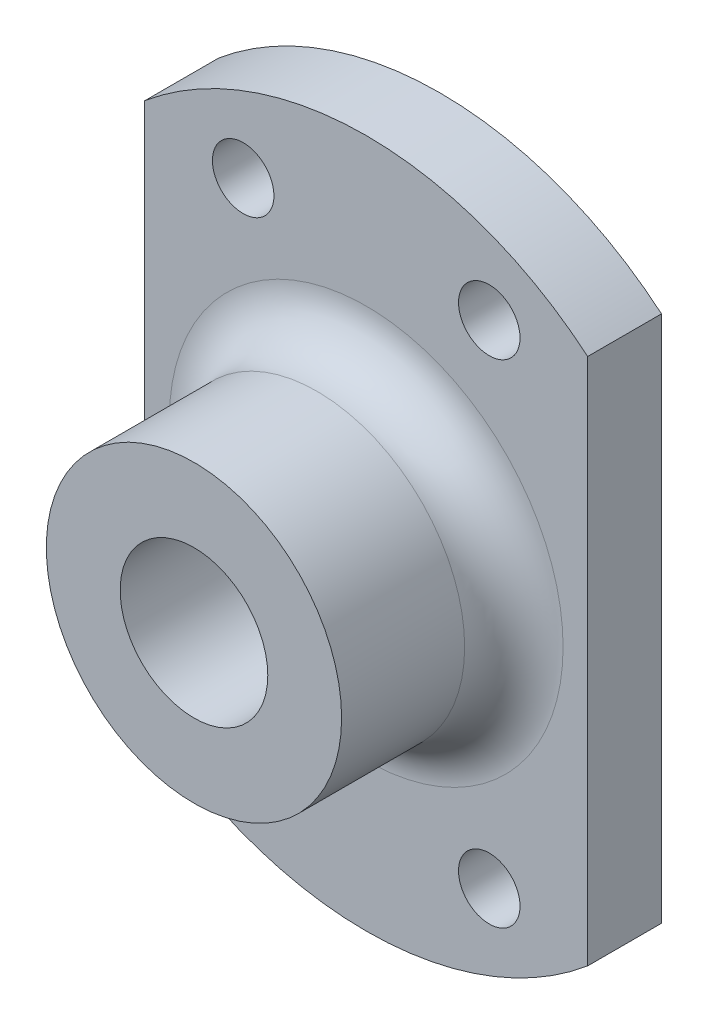
ISO-10303-21;
HEADER;
FILE_DESCRIPTION(('STEP AP214'),'2;1');
FILE_NAME('part.step','',(''),(''),'','','');
FILE_SCHEMA(('AUTOMOTIVE_DESIGN { 1 0 10303 214 1 1 1 1 }'));
ENDSEC;
DATA;
#1=APPLICATION_CONTEXT('core data for automotive mechanical design processes');
#2=APPLICATION_PROTOCOL_DEFINITION('international standard','automotive_design',2000,#1);
#3=PRODUCT_CONTEXT('',#1,'mechanical');
#4=PRODUCT('Part','Part','',(#3));
#5=PRODUCT_RELATED_PRODUCT_CATEGORY('part','',(#4));
#6=PRODUCT_DEFINITION_FORMATION('','',#4);
#7=PRODUCT_DEFINITION_CONTEXT('part definition',#1,'design');
#8=PRODUCT_DEFINITION('design','',#6,#7);
#9=PRODUCT_DEFINITION_SHAPE('','',#8);
#10=(LENGTH_UNIT() NAMED_UNIT(*) SI_UNIT(.MILLI.,.METRE.));
#11=(NAMED_UNIT(*) PLANE_ANGLE_UNIT() SI_UNIT($,.RADIAN.));
#12=(NAMED_UNIT(*) SI_UNIT($,.STERADIAN.) SOLID_ANGLE_UNIT());
#13=UNCERTAINTY_MEASURE_WITH_UNIT(LENGTH_MEASURE(1.E-05),#10,'distance_accuracy_value','');
#14=(GEOMETRIC_REPRESENTATION_CONTEXT(3) GLOBAL_UNCERTAINTY_ASSIGNED_CONTEXT((#13)) GLOBAL_UNIT_ASSIGNED_CONTEXT((#10,
#11,#12)) REPRESENTATION_CONTEXT('',''));
#15=CARTESIAN_POINT('',(0.,0.,0.));
#16=DIRECTION('',(0.,0.,1.));
#17=DIRECTION('',(1.,0.,0.));
#18=AXIS2_PLACEMENT_3D('',#15,#16,#17);
#19=CARTESIAN_POINT('',(0.,0.,3.));
#20=DIRECTION('',(0.,0.,1.));
#21=DIRECTION('',(1.,0.,0.));
#22=AXIS2_PLACEMENT_3D('',#19,#20,#21);
#23=PLANE('',#22);
#24=CARTESIAN_POINT('',(0.,0.,3.));
#25=DIRECTION('',(0.,0.,1.));
#26=DIRECTION('',(1.,0.,0.));
#27=AXIS2_PLACEMENT_3D('',#24,#25,#26);
#28=CIRCLE('',#27,8.);
#29=CARTESIAN_POINT('',(8.,0.,3.));
#30=VERTEX_POINT('',#29);
#31=EDGE_CURVE('E11',#30,#30,#28,.F.);
#32=ORIENTED_EDGE('',*,*,#31,.T.);
#33=EDGE_LOOP('',(#32));
#34=FACE_BOUND('',#33,.T.);
#35=CARTESIAN_POINT('',(5.,-10.,3.));
#36=DIRECTION('',(0.,0.,1.));
#37=DIRECTION('',(1.,0.,0.));
#38=AXIS2_PLACEMENT_3D('',#35,#36,#37);
#39=CIRCLE('',#38,1.25);
#40=CARTESIAN_POINT('',(6.25,-10.,3.));
#41=VERTEX_POINT('',#40);
#42=EDGE_CURVE('E170',#41,#41,#39,.T.);
#43=ORIENTED_EDGE('',*,*,#42,.F.);
#44=EDGE_LOOP('',(#43));
#45=FACE_BOUND('',#44,.T.);
#46=CARTESIAN_POINT('',(5.,10.,3.));
#47=DIRECTION('',(0.,0.,1.));
#48=DIRECTION('',(1.,0.,0.));
#49=AXIS2_PLACEMENT_3D('',#46,#47,#48);
#50=CIRCLE('',#49,1.25);
#51=CARTESIAN_POINT('',(6.25,10.,3.));
#52=VERTEX_POINT('',#51);
#53=EDGE_CURVE('E183',#52,#52,#50,.T.);
#54=ORIENTED_EDGE('',*,*,#53,.F.);
#55=EDGE_LOOP('',(#54));
#56=FACE_BOUND('',#55,.T.);
#57=CARTESIAN_POINT('',(0.,0.,3.));
#58=DIRECTION('',(0.,0.,1.));
#59=DIRECTION('',(1.,0.,0.));
#60=AXIS2_PLACEMENT_3D('',#57,#58,#59);
#61=CIRCLE('',#60,14.);
#62=CARTESIAN_POINT('',(9.,10.7238052947636,3.));
#63=VERTEX_POINT('',#62);
#64=CARTESIAN_POINT('',(-9.,10.7238052947636,3.));
#65=VERTEX_POINT('',#64);
#66=EDGE_CURVE('E86',#63,#65,#61,.T.);
#67=ORIENTED_EDGE('',*,*,#66,.T.);
#68=DIRECTION('',(0.,-1.,0.));
#69=VECTOR('',#68,1.);
#70=CARTESIAN_POINT('',(-9.,10.7238052947636,3.));
#71=LINE('',#70,#69);
#72=CARTESIAN_POINT('',(-9.,-10.7238052947636,3.));
#73=VERTEX_POINT('',#72);
#74=EDGE_CURVE('E81',#65,#73,#71,.T.);
#75=ORIENTED_EDGE('',*,*,#74,.T.);
#76=CARTESIAN_POINT('',(0.,0.,3.));
#77=DIRECTION('',(0.,0.,1.));
#78=DIRECTION('',(1.,0.,0.));
#79=AXIS2_PLACEMENT_3D('',#76,#77,#78);
#80=CIRCLE('',#79,14.);
#81=CARTESIAN_POINT('',(9.,-10.7238052947636,3.));
#82=VERTEX_POINT('',#81);
#83=EDGE_CURVE('E84',#73,#82,#80,.T.);
#84=ORIENTED_EDGE('',*,*,#83,.T.);
#85=DIRECTION('',(0.,1.,0.));
#86=VECTOR('',#85,1.);
#87=CARTESIAN_POINT('',(9.,10.7238052947636,3.));
#88=LINE('',#87,#86);
#89=EDGE_CURVE('E50',#82,#63,#88,.T.);
#90=ORIENTED_EDGE('',*,*,#89,.T.);
#91=EDGE_LOOP('',(#67,#75,#84,#90));
#92=FACE_BOUND('',#91,.T.);
#93=CARTESIAN_POINT('',(-5.,10.,3.));
#94=DIRECTION('',(0.,0.,1.));
#95=DIRECTION('',(1.,0.,0.));
#96=AXIS2_PLACEMENT_3D('',#93,#94,#95);
#97=CIRCLE('',#96,1.25);
#98=CARTESIAN_POINT('',(-3.75,10.,3.));
#99=VERTEX_POINT('',#98);
#100=EDGE_CURVE('E187',#99,#99,#97,.T.);
#101=ORIENTED_EDGE('',*,*,#100,.F.);
#102=EDGE_LOOP('',(#101));
#103=FACE_BOUND('',#102,.T.);
#104=CARTESIAN_POINT('',(-5.,-10.,3.));
#105=DIRECTION('',(0.,0.,1.));
#106=DIRECTION('',(1.,0.,0.));
#107=AXIS2_PLACEMENT_3D('',#104,#105,#106);
#108=CIRCLE('',#107,1.25);
#109=CARTESIAN_POINT('',(-3.75,-10.,3.));
#110=VERTEX_POINT('',#109);
#111=EDGE_CURVE('E179',#110,#110,#108,.T.);
#112=ORIENTED_EDGE('',*,*,#111,.F.);
#113=EDGE_LOOP('',(#112));
#114=FACE_BOUND('',#113,.T.);
#115=ADVANCED_FACE('F33',(#34,#45,#56,#92,#103,#114),#23,.T.);
#116=CARTESIAN_POINT('',(0.,0.,0.));
#117=DIRECTION('',(0.,0.,1.));
#118=DIRECTION('',(1.,0.,0.));
#119=AXIS2_PLACEMENT_3D('',#116,#117,#118);
#120=PLANE('',#119);
#121=CARTESIAN_POINT('',(0.,0.,0.));
#122=DIRECTION('',(0.,0.,1.));
#123=DIRECTION('',(1.,0.,0.));
#124=AXIS2_PLACEMENT_3D('',#121,#122,#123);
#125=CIRCLE('',#124,14.);
#126=CARTESIAN_POINT('',(9.,10.7238052947636,0.));
#127=VERTEX_POINT('',#126);
#128=CARTESIAN_POINT('',(-9.,10.7238052947636,0.));
#129=VERTEX_POINT('',#128);
#130=EDGE_CURVE('E101',#127,#129,#125,.T.);
#131=ORIENTED_EDGE('',*,*,#130,.F.);
#132=DIRECTION('',(0.,1.,0.));
#133=VECTOR('',#132,1.);
#134=CARTESIAN_POINT('',(9.,10.7238052947636,0.));
#135=LINE('',#134,#133);
#136=CARTESIAN_POINT('',(9.,-10.7238052947636,0.));
#137=VERTEX_POINT('',#136);
#138=EDGE_CURVE('E73',#137,#127,#135,.T.);
#139=ORIENTED_EDGE('',*,*,#138,.F.);
#140=CARTESIAN_POINT('',(0.,0.,0.));
#141=DIRECTION('',(0.,0.,1.));
#142=DIRECTION('',(1.,0.,0.));
#143=AXIS2_PLACEMENT_3D('',#140,#141,#142);
#144=CIRCLE('',#143,14.);
#145=CARTESIAN_POINT('',(-9.,-10.7238052947636,0.));
#146=VERTEX_POINT('',#145);
#147=EDGE_CURVE('E67',#146,#137,#144,.T.);
#148=ORIENTED_EDGE('',*,*,#147,.F.);
#149=DIRECTION('',(0.,-1.,0.));
#150=VECTOR('',#149,1.);
#151=CARTESIAN_POINT('',(-9.,10.7238052947636,0.));
#152=LINE('',#151,#150);
#153=EDGE_CURVE('E91',#129,#146,#152,.T.);
#154=ORIENTED_EDGE('',*,*,#153,.F.);
#155=EDGE_LOOP('',(#131,#139,#148,#154));
#156=FACE_BOUND('',#155,.T.);
#157=CARTESIAN_POINT('',(0.,0.,0.));
#158=DIRECTION('',(0.,0.,1.));
#159=DIRECTION('',(1.,0.,0.));
#160=AXIS2_PLACEMENT_3D('',#157,#158,#159);
#161=CIRCLE('',#160,3.);
#162=CARTESIAN_POINT('',(3.,0.,0.));
#163=VERTEX_POINT('',#162);
#164=EDGE_CURVE('E104',#163,#163,#161,.T.);
#165=ORIENTED_EDGE('',*,*,#164,.T.);
#166=EDGE_LOOP('',(#165));
#167=FACE_BOUND('',#166,.T.);
#168=CARTESIAN_POINT('',(-5.,10.,0.));
#169=DIRECTION('',(0.,0.,1.));
#170=DIRECTION('',(1.,0.,0.));
#171=AXIS2_PLACEMENT_3D('',#168,#169,#170);
#172=CIRCLE('',#171,1.25);
#173=CARTESIAN_POINT('',(-3.75,10.,0.));
#174=VERTEX_POINT('',#173);
#175=EDGE_CURVE('E157',#174,#174,#172,.T.);
#176=ORIENTED_EDGE('',*,*,#175,.T.);
#177=EDGE_LOOP('',(#176));
#178=FACE_BOUND('',#177,.T.);
#179=CARTESIAN_POINT('',(5.,10.,0.));
#180=DIRECTION('',(0.,0.,1.));
#181=DIRECTION('',(1.,0.,0.));
#182=AXIS2_PLACEMENT_3D('',#179,#180,#181);
#183=CIRCLE('',#182,1.25);
#184=CARTESIAN_POINT('',(6.25,10.,0.));
#185=VERTEX_POINT('',#184);
#186=EDGE_CURVE('E161',#185,#185,#183,.T.);
#187=ORIENTED_EDGE('',*,*,#186,.T.);
#188=EDGE_LOOP('',(#187));
#189=FACE_BOUND('',#188,.T.);
#190=CARTESIAN_POINT('',(-5.,-10.,0.));
#191=DIRECTION('',(0.,0.,1.));
#192=DIRECTION('',(1.,0.,0.));
#193=AXIS2_PLACEMENT_3D('',#190,#191,#192);
#194=CIRCLE('',#193,1.25);
#195=CARTESIAN_POINT('',(-3.75,-10.,0.));
#196=VERTEX_POINT('',#195);
#197=EDGE_CURVE('E165',#196,#196,#194,.T.);
#198=ORIENTED_EDGE('',*,*,#197,.T.);
#199=EDGE_LOOP('',(#198));
#200=FACE_BOUND('',#199,.T.);
#201=CARTESIAN_POINT('',(5.,-10.,0.));
#202=DIRECTION('',(0.,0.,1.));
#203=DIRECTION('',(1.,0.,0.));
#204=AXIS2_PLACEMENT_3D('',#201,#202,#203);
#205=CIRCLE('',#204,1.25);
#206=CARTESIAN_POINT('',(6.25,-10.,0.));
#207=VERTEX_POINT('',#206);
#208=EDGE_CURVE('E168',#207,#207,#205,.T.);
#209=ORIENTED_EDGE('',*,*,#208,.T.);
#210=EDGE_LOOP('',(#209));
#211=FACE_BOUND('',#210,.T.);
#212=ADVANCED_FACE('F125',(#156,#167,#178,#189,#200,#211),#120,.F.);
#213=CARTESIAN_POINT('',(0.,0.,3.));
#214=DIRECTION('',(0.,0.,-1.));
#215=DIRECTION('',(-1.,0.,0.));
#216=AXIS2_PLACEMENT_3D('',#213,#214,#215);
#217=CYLINDRICAL_SURFACE('',#216,14.);
#218=ORIENTED_EDGE('',*,*,#130,.T.);
#219=DIRECTION('',(0.,0.,-1.));
#220=VECTOR('',#219,1.);
#221=CARTESIAN_POINT('',(-9.,10.7238052947636,3.));
#222=LINE('',#221,#220);
#223=EDGE_CURVE('E92',#65,#129,#222,.T.);
#224=ORIENTED_EDGE('',*,*,#223,.F.);
#225=ORIENTED_EDGE('',*,*,#66,.F.);
#226=DIRECTION('',(0.,0.,-1.));
#227=VECTOR('',#226,1.);
#228=CARTESIAN_POINT('',(9.,10.7238052947636,3.));
#229=LINE('',#228,#227);
#230=EDGE_CURVE('E97',#63,#127,#229,.T.);
#231=ORIENTED_EDGE('',*,*,#230,.T.);
#232=EDGE_LOOP('',(#218,#224,#225,#231));
#233=FACE_BOUND('',#232,.T.);
#234=ADVANCED_FACE('F131',(#233),#217,.T.);
#235=CARTESIAN_POINT('',(-9.,10.7238052947636,3.));
#236=DIRECTION('',(1.,0.,0.));
#237=DIRECTION('',(0.,0.,-1.));
#238=AXIS2_PLACEMENT_3D('',#235,#236,#237);
#239=PLANE('',#238);
#240=ORIENTED_EDGE('',*,*,#153,.T.);
#241=DIRECTION('',(0.,0.,-1.));
#242=VECTOR('',#241,1.);
#243=CARTESIAN_POINT('',(-9.,-10.7238052947636,3.));
#244=LINE('',#243,#242);
#245=EDGE_CURVE('E89',#73,#146,#244,.T.);
#246=ORIENTED_EDGE('',*,*,#245,.F.);
#247=ORIENTED_EDGE('',*,*,#74,.F.);
#248=ORIENTED_EDGE('',*,*,#223,.T.);
#249=EDGE_LOOP('',(#240,#246,#247,#248));
#250=FACE_BOUND('',#249,.T.);
#251=ADVANCED_FACE('F90',(#250),#239,.F.);
#252=CARTESIAN_POINT('',(0.,0.,3.));
#253=DIRECTION('',(0.,0.,-1.));
#254=DIRECTION('',(-1.,0.,0.));
#255=AXIS2_PLACEMENT_3D('',#252,#253,#254);
#256=CYLINDRICAL_SURFACE('',#255,14.);
#257=ORIENTED_EDGE('',*,*,#147,.T.);
#258=DIRECTION('',(0.,0.,-1.));
#259=VECTOR('',#258,1.);
#260=CARTESIAN_POINT('',(9.,-10.7238052947636,3.));
#261=LINE('',#260,#259);
#262=EDGE_CURVE('E93',#82,#137,#261,.T.);
#263=ORIENTED_EDGE('',*,*,#262,.F.);
#264=ORIENTED_EDGE('',*,*,#83,.F.);
#265=ORIENTED_EDGE('',*,*,#245,.T.);
#266=EDGE_LOOP('',(#257,#263,#264,#265));
#267=FACE_BOUND('',#266,.T.);
#268=ADVANCED_FACE('F95',(#267),#256,.T.);
#269=CARTESIAN_POINT('',(9.,10.7238052947636,3.));
#270=DIRECTION('',(-1.,0.,0.));
#271=DIRECTION('',(0.,0.,1.));
#272=AXIS2_PLACEMENT_3D('',#269,#270,#271);
#273=PLANE('',#272);
#274=ORIENTED_EDGE('',*,*,#138,.T.);
#275=ORIENTED_EDGE('',*,*,#230,.F.);
#276=ORIENTED_EDGE('',*,*,#89,.F.);
#277=ORIENTED_EDGE('',*,*,#262,.T.);
#278=EDGE_LOOP('',(#274,#275,#276,#277));
#279=FACE_BOUND('',#278,.T.);
#280=ADVANCED_FACE('F139',(#279),#273,.F.);
#281=CARTESIAN_POINT('',(0.,0.,3.));
#282=DIRECTION('',(0.,0.,-1.));
#283=DIRECTION('',(-1.,0.,0.));
#284=AXIS2_PLACEMENT_3D('',#281,#282,#283);
#285=CYLINDRICAL_SURFACE('',#284,3.);
#286=ORIENTED_EDGE('',*,*,#164,.F.);
#287=EDGE_LOOP('',(#286));
#288=FACE_BOUND('',#287,.T.);
#289=CARTESIAN_POINT('',(0.,0.,10.));
#290=DIRECTION('',(0.,0.,1.));
#291=DIRECTION('',(1.,0.,0.));
#292=AXIS2_PLACEMENT_3D('',#289,#290,#291);
#293=CIRCLE('',#292,3.);
#294=CARTESIAN_POINT('',(3.,0.,10.));
#295=VERTEX_POINT('',#294);
#296=EDGE_CURVE('E176',#295,#295,#293,.T.);
#297=ORIENTED_EDGE('',*,*,#296,.T.);
#298=EDGE_LOOP('',(#297));
#299=FACE_BOUND('',#298,.T.);
#300=ADVANCED_FACE('F136',(#288,#299),#285,.F.);
#301=CARTESIAN_POINT('',(-5.,10.,3.));
#302=DIRECTION('',(0.,0.,-1.));
#303=DIRECTION('',(-1.,0.,0.));
#304=AXIS2_PLACEMENT_3D('',#301,#302,#303);
#305=CYLINDRICAL_SURFACE('',#304,1.25);
#306=ORIENTED_EDGE('',*,*,#100,.T.);
#307=EDGE_LOOP('',(#306));
#308=FACE_BOUND('',#307,.T.);
#309=ORIENTED_EDGE('',*,*,#175,.F.);
#310=EDGE_LOOP('',(#309));
#311=FACE_BOUND('',#310,.T.);
#312=ADVANCED_FACE('F193',(#308,#311),#305,.F.);
#313=CARTESIAN_POINT('',(5.,10.,3.));
#314=DIRECTION('',(0.,0.,-1.));
#315=DIRECTION('',(-1.,0.,0.));
#316=AXIS2_PLACEMENT_3D('',#313,#314,#315);
#317=CYLINDRICAL_SURFACE('',#316,1.25);
#318=ORIENTED_EDGE('',*,*,#53,.T.);
#319=EDGE_LOOP('',(#318));
#320=FACE_BOUND('',#319,.T.);
#321=ORIENTED_EDGE('',*,*,#186,.F.);
#322=EDGE_LOOP('',(#321));
#323=FACE_BOUND('',#322,.T.);
#324=ADVANCED_FACE('F202',(#320,#323),#317,.F.);
#325=CARTESIAN_POINT('',(-5.,-10.,3.));
#326=DIRECTION('',(0.,0.,-1.));
#327=DIRECTION('',(-1.,0.,0.));
#328=AXIS2_PLACEMENT_3D('',#325,#326,#327);
#329=CYLINDRICAL_SURFACE('',#328,1.25);
#330=ORIENTED_EDGE('',*,*,#111,.T.);
#331=EDGE_LOOP('',(#330));
#332=FACE_BOUND('',#331,.T.);
#333=ORIENTED_EDGE('',*,*,#197,.F.);
#334=EDGE_LOOP('',(#333));
#335=FACE_BOUND('',#334,.T.);
#336=ADVANCED_FACE('F198',(#332,#335),#329,.F.);
#337=CARTESIAN_POINT('',(5.,-10.,3.));
#338=DIRECTION('',(0.,0.,-1.));
#339=DIRECTION('',(-1.,0.,0.));
#340=AXIS2_PLACEMENT_3D('',#337,#338,#339);
#341=CYLINDRICAL_SURFACE('',#340,1.25);
#342=ORIENTED_EDGE('',*,*,#42,.T.);
#343=EDGE_LOOP('',(#342));
#344=FACE_BOUND('',#343,.T.);
#345=ORIENTED_EDGE('',*,*,#208,.F.);
#346=EDGE_LOOP('',(#345));
#347=FACE_BOUND('',#346,.T.);
#348=ADVANCED_FACE('F201',(#344,#347),#341,.F.);
#349=CARTESIAN_POINT('',(0.,0.,10.));
#350=DIRECTION('',(0.,0.,1.));
#351=DIRECTION('',(1.,0.,0.));
#352=AXIS2_PLACEMENT_3D('',#349,#350,#351);
#353=PLANE('',#352);
#354=CARTESIAN_POINT('',(0.,0.,10.));
#355=DIRECTION('',(0.,0.,1.));
#356=DIRECTION('',(1.,0.,0.));
#357=AXIS2_PLACEMENT_3D('',#354,#355,#356);
#358=CIRCLE('',#357,6.);
#359=CARTESIAN_POINT('',(6.,0.,10.));
#360=VERTEX_POINT('',#359);
#361=EDGE_CURVE('E171',#360,#360,#358,.T.);
#362=ORIENTED_EDGE('',*,*,#361,.T.);
#363=EDGE_LOOP('',(#362));
#364=FACE_BOUND('',#363,.T.);
#365=ORIENTED_EDGE('',*,*,#296,.F.);
#366=EDGE_LOOP('',(#365));
#367=FACE_BOUND('',#366,.T.);
#368=ADVANCED_FACE('F121',(#364,#367),#353,.T.);
#369=CARTESIAN_POINT('',(0.,0.,10.));
#370=DIRECTION('',(0.,0.,-1.));
#371=DIRECTION('',(-1.,0.,0.));
#372=AXIS2_PLACEMENT_3D('',#369,#370,#371);
#373=CYLINDRICAL_SURFACE('',#372,6.);
#374=CARTESIAN_POINT('',(0.,0.,5.));
#375=DIRECTION('',(0.,0.,1.));
#376=DIRECTION('',(1.,0.,0.));
#377=AXIS2_PLACEMENT_3D('',#374,#375,#376);
#378=CIRCLE('',#377,6.);
#379=CARTESIAN_POINT('',(6.,0.,5.));
#380=VERTEX_POINT('',#379);
#381=EDGE_CURVE('E42',#380,#380,#378,.T.);
#382=ORIENTED_EDGE('',*,*,#381,.T.);
#383=EDGE_LOOP('',(#382));
#384=FACE_BOUND('',#383,.T.);
#385=ORIENTED_EDGE('',*,*,#361,.F.);
#386=EDGE_LOOP('',(#385));
#387=FACE_BOUND('',#386,.T.);
#388=ADVANCED_FACE('F113',(#384,#387),#373,.T.);
#389=CARTESIAN_POINT('',(0.,0.,5.));
#390=DIRECTION('',(0.,0.,1.));
#391=DIRECTION('',(1.,0.,0.));
#392=AXIS2_PLACEMENT_3D('',#389,#390,#391);
#393=TOROIDAL_SURFACE('',#392,8.,2.);
#394=ORIENTED_EDGE('',*,*,#31,.F.);
#395=EDGE_LOOP('',(#394));
#396=FACE_BOUND('',#395,.T.);
#397=ORIENTED_EDGE('',*,*,#381,.F.);
#398=EDGE_LOOP('',(#397));
#399=FACE_BOUND('',#398,.T.);
#400=ADVANCED_FACE('F35',(#396,#399),#393,.F.);
#401=CLOSED_SHELL('',(#115,#212,#234,#251,#268,#280,#300,#312,#324,#336,#348,#368,#388,#400));
#402=MANIFOLD_SOLID_BREP('B2',#401);
#403=ADVANCED_BREP_SHAPE_REPRESENTATION('',(#18,#402),#14);
#404=SHAPE_DEFINITION_REPRESENTATION(#9,#403);
ENDSEC;
END-ISO-10303-21;
